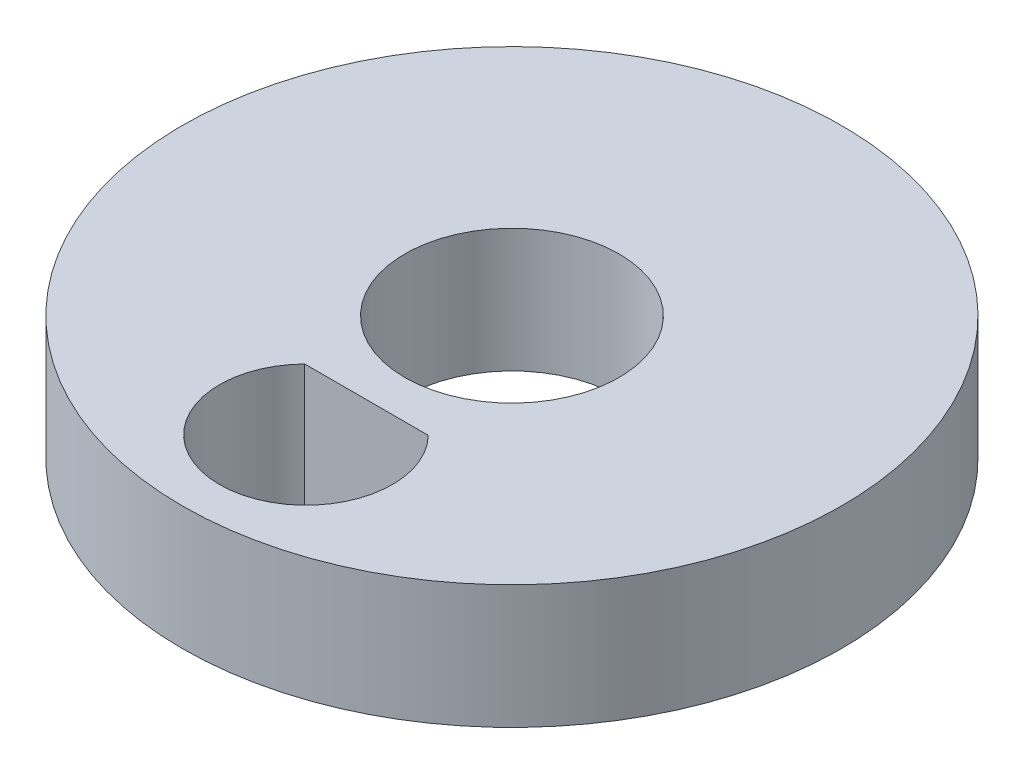
ISO-10303-21;
HEADER;
FILE_DESCRIPTION(('STEP AP214'),'2;1');
FILE_NAME('part.step','',(''),(''),'','','');
FILE_SCHEMA(('AUTOMOTIVE_DESIGN { 1 0 10303 214 1 1 1 1 }'));
ENDSEC;
DATA;
#1=APPLICATION_CONTEXT('core data for automotive mechanical design processes');
#2=APPLICATION_PROTOCOL_DEFINITION('international standard','automotive_design',2000,#1);
#3=PRODUCT_CONTEXT('',#1,'mechanical');
#4=PRODUCT('Part','Part','',(#3));
#5=PRODUCT_RELATED_PRODUCT_CATEGORY('part','',(#4));
#6=PRODUCT_DEFINITION_FORMATION('','',#4);
#7=PRODUCT_DEFINITION_CONTEXT('part definition',#1,'design');
#8=PRODUCT_DEFINITION('design','',#6,#7);
#9=PRODUCT_DEFINITION_SHAPE('','',#8);
#10=(LENGTH_UNIT() NAMED_UNIT(*) SI_UNIT(.MILLI.,.METRE.));
#11=(NAMED_UNIT(*) PLANE_ANGLE_UNIT() SI_UNIT($,.RADIAN.));
#12=(NAMED_UNIT(*) SI_UNIT($,.STERADIAN.) SOLID_ANGLE_UNIT());
#13=UNCERTAINTY_MEASURE_WITH_UNIT(LENGTH_MEASURE(1.E-05),#10,'distance_accuracy_value','');
#14=(GEOMETRIC_REPRESENTATION_CONTEXT(3) GLOBAL_UNCERTAINTY_ASSIGNED_CONTEXT((#13)) GLOBAL_UNIT_ASSIGNED_CONTEXT((#10,
#11,#12)) REPRESENTATION_CONTEXT('',''));
#15=CARTESIAN_POINT('',(0.,0.,0.));
#16=DIRECTION('',(0.,0.,1.));
#17=DIRECTION('',(1.,0.,0.));
#18=AXIS2_PLACEMENT_3D('',#15,#16,#17);
#19=CARTESIAN_POINT('',(0.,3.,0.));
#20=DIRECTION('',(0.,1.,0.));
#21=DIRECTION('',(0.,0.,1.));
#22=AXIS2_PLACEMENT_3D('',#19,#20,#21);
#23=PLANE('',#22);
#24=CARTESIAN_POINT('',(0.,3.,0.));
#25=DIRECTION('',(0.,1.,0.));
#26=DIRECTION('',(0.,0.,1.));
#27=AXIS2_PLACEMENT_3D('',#24,#25,#26);
#28=CIRCLE('',#27,8.);
#29=CARTESIAN_POINT('',(0.,3.,8.));
#30=VERTEX_POINT('',#29);
#31=EDGE_CURVE('E11',#30,#30,#28,.T.);
#32=ORIENTED_EDGE('',*,*,#31,.T.);
#33=EDGE_LOOP('',(#32));
#34=FACE_BOUND('',#33,.T.);
#35=CARTESIAN_POINT('',(0.,3.,0.));
#36=DIRECTION('',(0.,1.,0.));
#37=DIRECTION('',(0.,0.,1.));
#38=AXIS2_PLACEMENT_3D('',#35,#36,#37);
#39=CIRCLE('',#38,2.6);
#40=CARTESIAN_POINT('',(0.,3.,2.6));
#41=VERTEX_POINT('',#40);
#42=EDGE_CURVE('E86',#41,#41,#39,.T.);
#43=ORIENTED_EDGE('',*,*,#42,.F.);
#44=EDGE_LOOP('',(#43));
#45=FACE_BOUND('',#44,.T.);
#46=DIRECTION('',(-1.,0.,0.));
#47=VECTOR('',#46,1.);
#48=CARTESIAN_POINT('',(1.5,3.,3.53030615433009));
#49=LINE('',#48,#47);
#50=CARTESIAN_POINT('',(1.5,3.,3.53030615433009));
#51=VERTEX_POINT('',#50);
#52=CARTESIAN_POINT('',(-1.5,3.,3.53030615433009));
#53=VERTEX_POINT('',#52);
#54=EDGE_CURVE('E82',#51,#53,#49,.T.);
#55=ORIENTED_EDGE('',*,*,#54,.F.);
#56=CARTESIAN_POINT('',(0.,3.,5.));
#57=DIRECTION('',(0.,1.,0.));
#58=DIRECTION('',(0.,0.,1.));
#59=AXIS2_PLACEMENT_3D('',#56,#57,#58);
#60=CIRCLE('',#59,2.1);
#61=EDGE_CURVE('E72',#53,#51,#60,.T.);
#62=ORIENTED_EDGE('',*,*,#61,.F.);
#63=EDGE_LOOP('',(#55,#62));
#64=FACE_BOUND('',#63,.T.);
#65=ADVANCED_FACE('F40',(#34,#45,#64),#23,.T.);
#66=CARTESIAN_POINT('',(0.,0.,0.));
#67=DIRECTION('',(0.,1.,0.));
#68=DIRECTION('',(0.,0.,1.));
#69=AXIS2_PLACEMENT_3D('',#66,#67,#68);
#70=PLANE('',#69);
#71=CARTESIAN_POINT('',(0.,0.,0.));
#72=DIRECTION('',(0.,1.,0.));
#73=DIRECTION('',(0.,0.,1.));
#74=AXIS2_PLACEMENT_3D('',#71,#72,#73);
#75=CIRCLE('',#74,2.6);
#76=CARTESIAN_POINT('',(0.,0.,2.6));
#77=VERTEX_POINT('',#76);
#78=EDGE_CURVE('E77',#77,#77,#75,.T.);
#79=ORIENTED_EDGE('',*,*,#78,.T.);
#80=EDGE_LOOP('',(#79));
#81=FACE_BOUND('',#80,.T.);
#82=CARTESIAN_POINT('',(0.,0.,0.));
#83=DIRECTION('',(0.,1.,0.));
#84=DIRECTION('',(0.,0.,1.));
#85=AXIS2_PLACEMENT_3D('',#82,#83,#84);
#86=CIRCLE('',#85,8.);
#87=CARTESIAN_POINT('',(0.,0.,8.));
#88=VERTEX_POINT('',#87);
#89=EDGE_CURVE('E44',#88,#88,#86,.T.);
#90=ORIENTED_EDGE('',*,*,#89,.F.);
#91=EDGE_LOOP('',(#90));
#92=FACE_BOUND('',#91,.T.);
#93=CARTESIAN_POINT('',(0.,0.,5.));
#94=DIRECTION('',(0.,1.,0.));
#95=DIRECTION('',(0.,0.,1.));
#96=AXIS2_PLACEMENT_3D('',#93,#94,#95);
#97=CIRCLE('',#96,2.1);
#98=CARTESIAN_POINT('',(-1.5,0.,3.53030615433009));
#99=VERTEX_POINT('',#98);
#100=CARTESIAN_POINT('',(1.5,0.,3.53030615433009));
#101=VERTEX_POINT('',#100);
#102=EDGE_CURVE('E62',#99,#101,#97,.T.);
#103=ORIENTED_EDGE('',*,*,#102,.T.);
#104=DIRECTION('',(-1.,0.,0.));
#105=VECTOR('',#104,1.);
#106=CARTESIAN_POINT('',(1.5,0.,3.53030615433009));
#107=LINE('',#106,#105);
#108=EDGE_CURVE('E68',#101,#99,#107,.T.);
#109=ORIENTED_EDGE('',*,*,#108,.T.);
#110=EDGE_LOOP('',(#103,#109));
#111=FACE_BOUND('',#110,.T.);
#112=ADVANCED_FACE('F79',(#81,#92,#111),#70,.F.);
#113=CARTESIAN_POINT('',(0.,3.,0.));
#114=DIRECTION('',(0.,-1.,0.));
#115=DIRECTION('',(0.,0.,-1.));
#116=AXIS2_PLACEMENT_3D('',#113,#114,#115);
#117=CYLINDRICAL_SURFACE('',#116,8.);
#118=ORIENTED_EDGE('',*,*,#31,.F.);
#119=EDGE_LOOP('',(#118));
#120=FACE_BOUND('',#119,.T.);
#121=ORIENTED_EDGE('',*,*,#89,.T.);
#122=EDGE_LOOP('',(#121));
#123=FACE_BOUND('',#122,.T.);
#124=ADVANCED_FACE('F42',(#120,#123),#117,.T.);
#125=CARTESIAN_POINT('',(0.,3.,0.));
#126=DIRECTION('',(0.,-1.,0.));
#127=DIRECTION('',(0.,0.,-1.));
#128=AXIS2_PLACEMENT_3D('',#125,#126,#127);
#129=CYLINDRICAL_SURFACE('',#128,2.6);
#130=ORIENTED_EDGE('',*,*,#42,.T.);
#131=EDGE_LOOP('',(#130));
#132=FACE_BOUND('',#131,.T.);
#133=ORIENTED_EDGE('',*,*,#78,.F.);
#134=EDGE_LOOP('',(#133));
#135=FACE_BOUND('',#134,.T.);
#136=ADVANCED_FACE('F94',(#132,#135),#129,.F.);
#137=CARTESIAN_POINT('',(0.,3.,5.));
#138=DIRECTION('',(0.,-1.,0.));
#139=DIRECTION('',(0.,0.,-1.));
#140=AXIS2_PLACEMENT_3D('',#137,#138,#139);
#141=CYLINDRICAL_SURFACE('',#140,2.1);
#142=ORIENTED_EDGE('',*,*,#102,.F.);
#143=DIRECTION('',(0.,-1.,0.));
#144=VECTOR('',#143,1.);
#145=CARTESIAN_POINT('',(-1.5,3.,3.53030615433009));
#146=LINE('',#145,#144);
#147=EDGE_CURVE('E70',#53,#99,#146,.T.);
#148=ORIENTED_EDGE('',*,*,#147,.F.);
#149=ORIENTED_EDGE('',*,*,#61,.T.);
#150=DIRECTION('',(0.,-1.,0.));
#151=VECTOR('',#150,1.);
#152=CARTESIAN_POINT('',(1.5,3.,3.53030615433009));
#153=LINE('',#152,#151);
#154=EDGE_CURVE('E55',#51,#101,#153,.T.);
#155=ORIENTED_EDGE('',*,*,#154,.T.);
#156=EDGE_LOOP('',(#142,#148,#149,#155));
#157=FACE_BOUND('',#156,.T.);
#158=ADVANCED_FACE('F74',(#157),#141,.F.);
#159=CARTESIAN_POINT('',(1.5,3.,3.53030615433009));
#160=DIRECTION('',(0.,0.,1.));
#161=DIRECTION('',(1.,0.,0.));
#162=AXIS2_PLACEMENT_3D('',#159,#160,#161);
#163=PLANE('',#162);
#164=ORIENTED_EDGE('',*,*,#108,.F.);
#165=ORIENTED_EDGE('',*,*,#154,.F.);
#166=ORIENTED_EDGE('',*,*,#54,.T.);
#167=ORIENTED_EDGE('',*,*,#147,.T.);
#168=EDGE_LOOP('',(#164,#165,#166,#167));
#169=FACE_BOUND('',#168,.T.);
#170=ADVANCED_FACE('F69',(#169),#163,.T.);
#171=CLOSED_SHELL('',(#65,#112,#124,#136,#158,#170));
#172=MANIFOLD_SOLID_BREP('B2',#171);
#173=ADVANCED_BREP_SHAPE_REPRESENTATION('',(#18,#172),#14);
#174=SHAPE_DEFINITION_REPRESENTATION(#9,#173);
ENDSEC;
END-ISO-10303-21;
